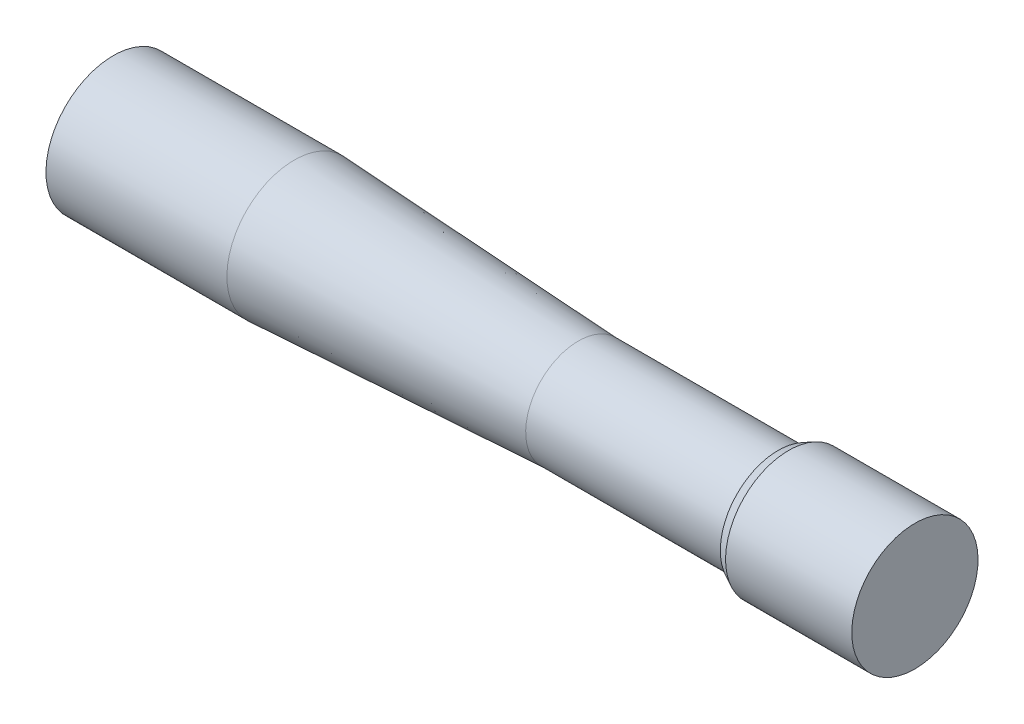
ISO-10303-21;
HEADER;
FILE_DESCRIPTION(('STEP AP214'),'2;1');
FILE_NAME('part.step','',(''),(''),'','','');
FILE_SCHEMA(('AUTOMOTIVE_DESIGN { 1 0 10303 214 1 1 1 1 }'));
ENDSEC;
DATA;
#1=APPLICATION_CONTEXT('core data for automotive mechanical design processes');
#2=APPLICATION_PROTOCOL_DEFINITION('international standard','automotive_design',2000,#1);
#3=PRODUCT_CONTEXT('',#1,'mechanical');
#4=PRODUCT('Part','Part','',(#3));
#5=PRODUCT_RELATED_PRODUCT_CATEGORY('part','',(#4));
#6=PRODUCT_DEFINITION_FORMATION('','',#4);
#7=PRODUCT_DEFINITION_CONTEXT('part definition',#1,'design');
#8=PRODUCT_DEFINITION('design','',#6,#7);
#9=PRODUCT_DEFINITION_SHAPE('','',#8);
#10=(LENGTH_UNIT() NAMED_UNIT(*) SI_UNIT(.MILLI.,.METRE.));
#11=(NAMED_UNIT(*) PLANE_ANGLE_UNIT() SI_UNIT($,.RADIAN.));
#12=(NAMED_UNIT(*) SI_UNIT($,.STERADIAN.) SOLID_ANGLE_UNIT());
#13=UNCERTAINTY_MEASURE_WITH_UNIT(LENGTH_MEASURE(1.E-05),#10,'distance_accuracy_value','');
#14=(GEOMETRIC_REPRESENTATION_CONTEXT(3) GLOBAL_UNCERTAINTY_ASSIGNED_CONTEXT((#13)) GLOBAL_UNIT_ASSIGNED_CONTEXT((#10,
#11,#12)) REPRESENTATION_CONTEXT('',''));
#15=CARTESIAN_POINT('',(0.,0.,0.));
#16=DIRECTION('',(0.,0.,1.));
#17=DIRECTION('',(1.,0.,0.));
#18=AXIS2_PLACEMENT_3D('',#15,#16,#17);
#19=CARTESIAN_POINT('',(5.,3.,0.));
#20=DIRECTION('',(-1.,0.,0.));
#21=DIRECTION('',(0.,0.,1.));
#22=AXIS2_PLACEMENT_3D('',#19,#20,#21);
#23=PLANE('',#22);
#24=CARTESIAN_POINT('',(5.,0.,0.));
#25=DIRECTION('',(1.,0.,0.));
#26=DIRECTION('',(0.,0.,-1.));
#27=AXIS2_PLACEMENT_3D('',#24,#25,#26);
#28=CIRCLE('',#27,3.);
#29=CARTESIAN_POINT('',(5.,-3.,0.));
#30=VERTEX_POINT('',#29);
#31=EDGE_CURVE('E102',#30,#30,#28,.T.);
#32=ORIENTED_EDGE('',*,*,#31,.F.);
#33=EDGE_LOOP('',(#32));
#34=FACE_BOUND('',#33,.T.);
#35=ADVANCED_FACE('F16',(#34),#23,.T.);
#36=CARTESIAN_POINT('',(76.2,0.,0.));
#37=DIRECTION('',(1.,0.,0.));
#38=DIRECTION('',(0.,1.,0.));
#39=AXIS2_PLACEMENT_3D('',#36,#37,#38);
#40=PLANE('',#39);
#41=CARTESIAN_POINT('',(76.2,0.,0.));
#42=DIRECTION('',(1.,0.,0.));
#43=DIRECTION('',(0.,0.,-1.));
#44=AXIS2_PLACEMENT_3D('',#41,#42,#43);
#45=CIRCLE('',#44,6.);
#46=CARTESIAN_POINT('',(76.2,-6.,0.));
#47=VERTEX_POINT('',#46);
#48=EDGE_CURVE('E27',#47,#47,#45,.T.);
#49=ORIENTED_EDGE('',*,*,#48,.T.);
#50=EDGE_LOOP('',(#49));
#51=FACE_BOUND('',#50,.T.);
#52=ADVANCED_FACE('F18',(#51),#40,.T.);
#53=CARTESIAN_POINT('',(70.2,0.,0.));
#54=DIRECTION('',(1.,0.,0.));
#55=DIRECTION('',(0.,1.,0.));
#56=AXIS2_PLACEMENT_3D('',#53,#54,#55);
#57=CYLINDRICAL_SURFACE('',#56,6.);
#58=ORIENTED_EDGE('',*,*,#48,.F.);
#59=DIRECTION('',(-1.,0.,0.));
#60=VECTOR('',#59,1.);
#61=CARTESIAN_POINT('',(70.2,-6.,0.));
#62=LINE('',#61,#60);
#63=CARTESIAN_POINT('',(64.2,-6.,0.));
#64=VERTEX_POINT('',#63);
#65=EDGE_CURVE('E11',#47,#64,#62,.T.);
#66=ORIENTED_EDGE('',*,*,#65,.T.);
#67=CARTESIAN_POINT('',(64.2,0.,0.));
#68=DIRECTION('',(1.,0.,0.));
#69=DIRECTION('',(0.,0.,-1.));
#70=AXIS2_PLACEMENT_3D('',#67,#68,#69);
#71=CIRCLE('',#70,6.);
#72=EDGE_CURVE('E85',#64,#64,#71,.T.);
#73=ORIENTED_EDGE('',*,*,#72,.T.);
#74=ORIENTED_EDGE('',*,*,#65,.F.);
#75=EDGE_LOOP('',(#58,#66,#73,#74));
#76=FACE_BOUND('',#75,.T.);
#77=ADVANCED_FACE('F144',(#76),#57,.T.);
#78=CARTESIAN_POINT('',(63.7,0.,0.));
#79=DIRECTION('',(1.,0.,0.));
#80=DIRECTION('',(0.,1.,0.));
#81=AXIS2_PLACEMENT_3D('',#78,#79,#80);
#82=CONICAL_SURFACE('',#81,5.75,0.463647609000807);
#83=ORIENTED_EDGE('',*,*,#72,.F.);
#84=DIRECTION('',(-0.894427190999915,0.447213595499959,0.));
#85=VECTOR('',#84,1.);
#86=CARTESIAN_POINT('',(63.7,-5.75,0.));
#87=LINE('',#86,#85);
#88=CARTESIAN_POINT('',(63.2,-5.5,0.));
#89=VERTEX_POINT('',#88);
#90=EDGE_CURVE('E82',#64,#89,#87,.T.);
#91=ORIENTED_EDGE('',*,*,#90,.T.);
#92=CARTESIAN_POINT('',(63.2,0.,0.));
#93=DIRECTION('',(1.,0.,0.));
#94=DIRECTION('',(0.,0.,-1.));
#95=AXIS2_PLACEMENT_3D('',#92,#93,#94);
#96=CIRCLE('',#95,5.5);
#97=EDGE_CURVE('E20',#89,#89,#96,.T.);
#98=ORIENTED_EDGE('',*,*,#97,.T.);
#99=ORIENTED_EDGE('',*,*,#90,.F.);
#100=EDGE_LOOP('',(#83,#91,#98,#99));
#101=FACE_BOUND('',#100,.T.);
#102=ADVANCED_FACE('F83',(#101),#82,.T.);
#103=CARTESIAN_POINT('',(63.2,5.5,0.));
#104=DIRECTION('',(-1.,0.,0.));
#105=DIRECTION('',(0.,0.,1.));
#106=AXIS2_PLACEMENT_3D('',#103,#104,#105);
#107=PLANE('',#106);
#108=CARTESIAN_POINT('',(63.2,0.,0.));
#109=DIRECTION('',(1.,0.,0.));
#110=DIRECTION('',(0.,0.,-1.));
#111=AXIS2_PLACEMENT_3D('',#108,#109,#110);
#112=CIRCLE('',#111,5.);
#113=CARTESIAN_POINT('',(63.2,-5.,0.));
#114=VERTEX_POINT('',#113);
#115=EDGE_CURVE('E103',#114,#114,#112,.T.);
#116=ORIENTED_EDGE('',*,*,#115,.T.);
#117=EDGE_LOOP('',(#116));
#118=FACE_BOUND('',#117,.T.);
#119=ORIENTED_EDGE('',*,*,#97,.F.);
#120=EDGE_LOOP('',(#119));
#121=FACE_BOUND('',#120,.T.);
#122=ADVANCED_FACE('F150',(#118,#121),#107,.T.);
#123=CARTESIAN_POINT('',(53.7,0.,0.));
#124=DIRECTION('',(1.,0.,0.));
#125=DIRECTION('',(0.,1.,0.));
#126=AXIS2_PLACEMENT_3D('',#123,#124,#125);
#127=CYLINDRICAL_SURFACE('',#126,5.);
#128=ORIENTED_EDGE('',*,*,#115,.F.);
#129=DIRECTION('',(-1.,0.,0.));
#130=VECTOR('',#129,1.);
#131=CARTESIAN_POINT('',(53.7,-5.,0.));
#132=LINE('',#131,#130);
#133=CARTESIAN_POINT('',(44.2,-5.,0.));
#134=VERTEX_POINT('',#133);
#135=EDGE_CURVE('E106',#114,#134,#132,.T.);
#136=ORIENTED_EDGE('',*,*,#135,.T.);
#137=CARTESIAN_POINT('',(44.2,0.,0.));
#138=DIRECTION('',(1.,0.,0.));
#139=DIRECTION('',(0.,0.,-1.));
#140=AXIS2_PLACEMENT_3D('',#137,#138,#139);
#141=CIRCLE('',#140,5.);
#142=EDGE_CURVE('E115',#134,#134,#141,.T.);
#143=ORIENTED_EDGE('',*,*,#142,.T.);
#144=ORIENTED_EDGE('',*,*,#135,.F.);
#145=EDGE_LOOP('',(#128,#136,#143,#144));
#146=FACE_BOUND('',#145,.T.);
#147=ADVANCED_FACE('F153',(#146),#127,.T.);
#148=CARTESIAN_POINT('',(30.6999999999994,0.,0.));
#149=DIRECTION('',(-1.,0.,0.));
#150=DIRECTION('',(0.,1.,0.));
#151=AXIS2_PLACEMENT_3D('',#148,#149,#150);
#152=CONICAL_SURFACE('',#151,5.7,0.051805456791);
#153=ORIENTED_EDGE('',*,*,#142,.F.);
#154=DIRECTION('',(-0.998658397413623,-0.0517822872732967,0.));
#155=VECTOR('',#154,1.);
#156=CARTESIAN_POINT('',(30.6999999999994,-5.7,0.));
#157=LINE('',#156,#155);
#158=CARTESIAN_POINT('',(17.1999999999987,-6.4,0.));
#159=VERTEX_POINT('',#158);
#160=EDGE_CURVE('E107',#134,#159,#157,.T.);
#161=ORIENTED_EDGE('',*,*,#160,.T.);
#162=CARTESIAN_POINT('',(17.1999999999987,0.,0.));
#163=DIRECTION('',(1.,0.,0.));
#164=DIRECTION('',(0.,0.,-1.));
#165=AXIS2_PLACEMENT_3D('',#162,#163,#164);
#166=CIRCLE('',#165,6.4);
#167=EDGE_CURVE('E97',#159,#159,#166,.T.);
#168=ORIENTED_EDGE('',*,*,#167,.T.);
#169=ORIENTED_EDGE('',*,*,#160,.F.);
#170=EDGE_LOOP('',(#153,#161,#168,#169));
#171=FACE_BOUND('',#170,.T.);
#172=ADVANCED_FACE('F165',(#171),#152,.T.);
#173=CARTESIAN_POINT('',(8.59999999999936,0.,0.));
#174=DIRECTION('',(1.,0.,0.));
#175=DIRECTION('',(0.,1.,0.));
#176=AXIS2_PLACEMENT_3D('',#173,#174,#175);
#177=CYLINDRICAL_SURFACE('',#176,6.4);
#178=ORIENTED_EDGE('',*,*,#167,.F.);
#179=DIRECTION('',(-1.,0.,0.));
#180=VECTOR('',#179,1.);
#181=CARTESIAN_POINT('',(8.59999999999936,-6.4,0.));
#182=LINE('',#181,#180);
#183=CARTESIAN_POINT('',(0.,-6.4,0.));
#184=VERTEX_POINT('',#183);
#185=EDGE_CURVE('E60',#159,#184,#182,.T.);
#186=ORIENTED_EDGE('',*,*,#185,.T.);
#187=CARTESIAN_POINT('',(0.,0.,0.));
#188=DIRECTION('',(1.,0.,0.));
#189=DIRECTION('',(0.,0.,-1.));
#190=AXIS2_PLACEMENT_3D('',#187,#188,#189);
#191=CIRCLE('',#190,6.4);
#192=EDGE_CURVE('E127',#184,#184,#191,.T.);
#193=ORIENTED_EDGE('',*,*,#192,.T.);
#194=ORIENTED_EDGE('',*,*,#185,.F.);
#195=EDGE_LOOP('',(#178,#186,#193,#194));
#196=FACE_BOUND('',#195,.T.);
#197=ADVANCED_FACE('F148',(#196),#177,.T.);
#198=CARTESIAN_POINT('',(0.,6.4,0.));
#199=DIRECTION('',(-1.,0.,0.));
#200=DIRECTION('',(0.,0.,1.));
#201=AXIS2_PLACEMENT_3D('',#198,#199,#200);
#202=PLANE('',#201);
#203=CARTESIAN_POINT('',(0.,0.,0.));
#204=DIRECTION('',(1.,0.,0.));
#205=DIRECTION('',(0.,0.,-1.));
#206=AXIS2_PLACEMENT_3D('',#203,#204,#205);
#207=CIRCLE('',#206,3.);
#208=CARTESIAN_POINT('',(0.,-3.,0.));
#209=VERTEX_POINT('',#208);
#210=EDGE_CURVE('E70',#209,#209,#207,.T.);
#211=ORIENTED_EDGE('',*,*,#210,.T.);
#212=EDGE_LOOP('',(#211));
#213=FACE_BOUND('',#212,.T.);
#214=ORIENTED_EDGE('',*,*,#192,.F.);
#215=EDGE_LOOP('',(#214));
#216=FACE_BOUND('',#215,.T.);
#217=ADVANCED_FACE('F154',(#213,#216),#202,.T.);
#218=CARTESIAN_POINT('',(2.5,0.,0.));
#219=DIRECTION('',(1.,0.,0.));
#220=DIRECTION('',(0.,1.,0.));
#221=AXIS2_PLACEMENT_3D('',#218,#219,#220);
#222=CYLINDRICAL_SURFACE('',#221,3.);
#223=ORIENTED_EDGE('',*,*,#31,.T.);
#224=DIRECTION('',(-1.,0.,0.));
#225=VECTOR('',#224,1.);
#226=CARTESIAN_POINT('',(2.5,-3.,0.));
#227=LINE('',#226,#225);
#228=EDGE_CURVE('E99',#30,#209,#227,.T.);
#229=ORIENTED_EDGE('',*,*,#228,.T.);
#230=ORIENTED_EDGE('',*,*,#210,.F.);
#231=ORIENTED_EDGE('',*,*,#228,.F.);
#232=EDGE_LOOP('',(#223,#229,#230,#231));
#233=FACE_BOUND('',#232,.T.);
#234=ADVANCED_FACE('F136',(#233),#222,.F.);
#235=CLOSED_SHELL('',(#35,#52,#77,#102,#122,#147,#172,#197,#217,#234));
#236=MANIFOLD_SOLID_BREP('B1',#235);
#237=ADVANCED_BREP_SHAPE_REPRESENTATION('',(#18,#236),#14);
#238=SHAPE_DEFINITION_REPRESENTATION(#9,#237);
ENDSEC;
END-ISO-10303-21;
